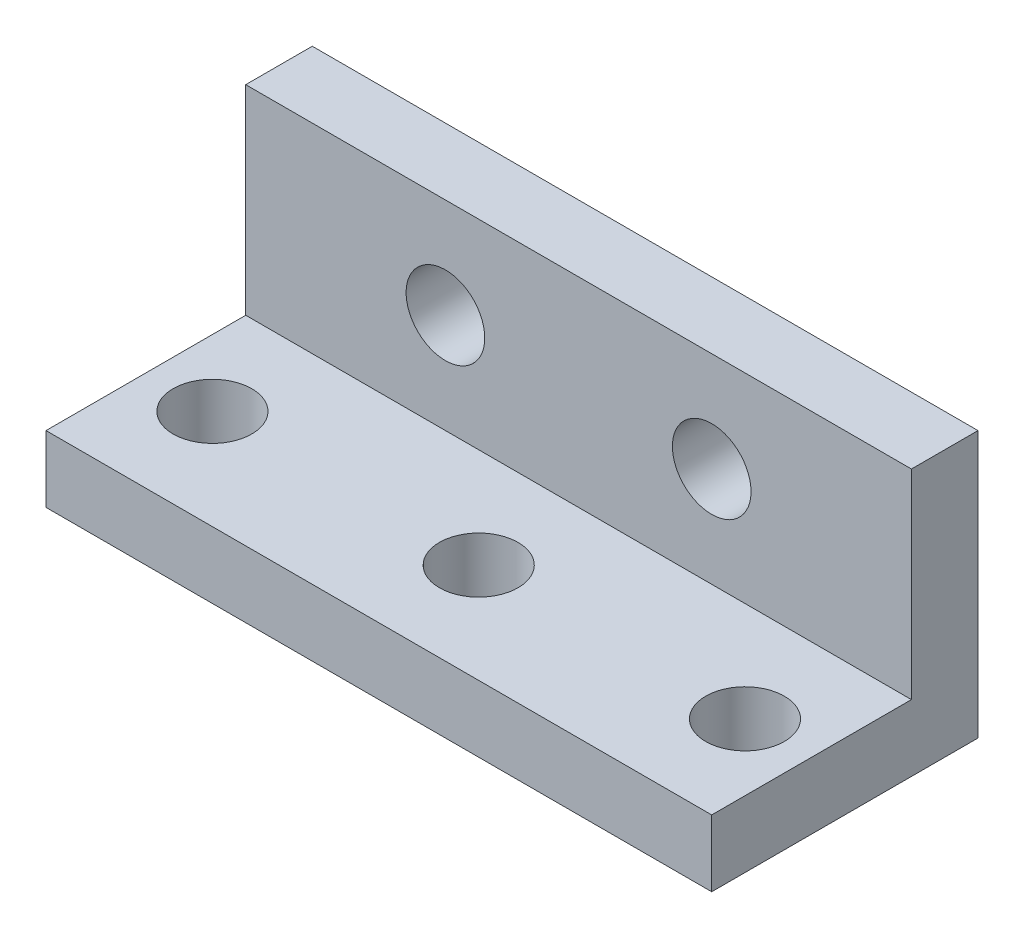
ISO-10303-21;
HEADER;
FILE_DESCRIPTION(('STEP AP214'),'2;1');
FILE_NAME('part.step','',(''),(''),'','','');
FILE_SCHEMA(('AUTOMOTIVE_DESIGN { 1 0 10303 214 1 1 1 1 }'));
ENDSEC;
DATA;
#1=APPLICATION_CONTEXT('core data for automotive mechanical design processes');
#2=APPLICATION_PROTOCOL_DEFINITION('international standard','automotive_design',2000,#1);
#3=PRODUCT_CONTEXT('',#1,'mechanical');
#4=PRODUCT('Part','Part','',(#3));
#5=PRODUCT_RELATED_PRODUCT_CATEGORY('part','',(#4));
#6=PRODUCT_DEFINITION_FORMATION('','',#4);
#7=PRODUCT_DEFINITION_CONTEXT('part definition',#1,'design');
#8=PRODUCT_DEFINITION('design','',#6,#7);
#9=PRODUCT_DEFINITION_SHAPE('','',#8);
#10=(LENGTH_UNIT() NAMED_UNIT(*) SI_UNIT(.MILLI.,.METRE.));
#11=(NAMED_UNIT(*) PLANE_ANGLE_UNIT() SI_UNIT($,.RADIAN.));
#12=(NAMED_UNIT(*) SI_UNIT($,.STERADIAN.) SOLID_ANGLE_UNIT());
#13=UNCERTAINTY_MEASURE_WITH_UNIT(LENGTH_MEASURE(1.E-05),#10,'distance_accuracy_value','');
#14=(GEOMETRIC_REPRESENTATION_CONTEXT(3) GLOBAL_UNCERTAINTY_ASSIGNED_CONTEXT((#13)) GLOBAL_UNIT_ASSIGNED_CONTEXT((#10,
#11,#12)) REPRESENTATION_CONTEXT('',''));
#15=CARTESIAN_POINT('',(0.,0.,0.));
#16=DIRECTION('',(0.,0.,1.));
#17=DIRECTION('',(1.,0.,0.));
#18=AXIS2_PLACEMENT_3D('',#15,#16,#17);
#19=CARTESIAN_POINT('',(25.4,0.,0.));
#20=DIRECTION('',(0.,0.,-1.));
#21=DIRECTION('',(-1.,0.,0.));
#22=AXIS2_PLACEMENT_3D('',#19,#20,#21);
#23=PLANE('',#22);
#24=DIRECTION('',(0.,-1.,0.));
#25=VECTOR('',#24,1.);
#26=CARTESIAN_POINT('',(25.4,0.,0.));
#27=LINE('',#26,#25);
#28=CARTESIAN_POINT('',(25.4,2.54,0.));
#29=VERTEX_POINT('',#28);
#30=CARTESIAN_POINT('',(25.4,0.,0.));
#31=VERTEX_POINT('',#30);
#32=EDGE_CURVE('E83',#29,#31,#27,.T.);
#33=ORIENTED_EDGE('',*,*,#32,.F.);
#34=DIRECTION('',(1.,0.,0.));
#35=VECTOR('',#34,1.);
#36=CARTESIAN_POINT('',(0.,2.54,0.));
#37=LINE('',#36,#35);
#38=CARTESIAN_POINT('',(0.,2.54,0.));
#39=VERTEX_POINT('',#38);
#40=EDGE_CURVE('E103',#39,#29,#37,.T.);
#41=ORIENTED_EDGE('',*,*,#40,.F.);
#42=DIRECTION('',(0.,-1.,0.));
#43=VECTOR('',#42,1.);
#44=CARTESIAN_POINT('',(0.,0.,0.));
#45=LINE('',#44,#43);
#46=CARTESIAN_POINT('',(0.,0.,0.));
#47=VERTEX_POINT('',#46);
#48=EDGE_CURVE('E111',#39,#47,#45,.T.);
#49=ORIENTED_EDGE('',*,*,#48,.T.);
#50=DIRECTION('',(-1.,0.,0.));
#51=VECTOR('',#50,1.);
#52=CARTESIAN_POINT('',(25.4,0.,0.));
#53=LINE('',#52,#51);
#54=EDGE_CURVE('E11',#31,#47,#53,.T.);
#55=ORIENTED_EDGE('',*,*,#54,.F.);
#56=EDGE_LOOP('',(#33,#41,#49,#55));
#57=FACE_BOUND('',#56,.T.);
#58=ADVANCED_FACE('F38',(#57),#23,.F.);
#59=CARTESIAN_POINT('',(25.4,0.,0.));
#60=DIRECTION('',(0.,1.,0.));
#61=DIRECTION('',(0.,0.,1.));
#62=AXIS2_PLACEMENT_3D('',#59,#60,#61);
#63=PLANE('',#62);
#64=CARTESIAN_POINT('',(2.54,0.,-3.81));
#65=DIRECTION('',(0.,1.,0.));
#66=DIRECTION('',(0.,0.,1.));
#67=AXIS2_PLACEMENT_3D('',#64,#65,#66);
#68=CIRCLE('',#67,1.5);
#69=CARTESIAN_POINT('',(2.54,0.,-2.31));
#70=VERTEX_POINT('',#69);
#71=EDGE_CURVE('E152',#70,#70,#68,.T.);
#72=ORIENTED_EDGE('',*,*,#71,.T.);
#73=EDGE_LOOP('',(#72));
#74=FACE_BOUND('',#73,.T.);
#75=CARTESIAN_POINT('',(22.86,0.,-3.81));
#76=DIRECTION('',(0.,1.,0.));
#77=DIRECTION('',(0.,0.,1.));
#78=AXIS2_PLACEMENT_3D('',#75,#76,#77);
#79=CIRCLE('',#78,1.5);
#80=CARTESIAN_POINT('',(22.86,0.,-2.31));
#81=VERTEX_POINT('',#80);
#82=EDGE_CURVE('E169',#81,#81,#79,.T.);
#83=ORIENTED_EDGE('',*,*,#82,.T.);
#84=EDGE_LOOP('',(#83));
#85=FACE_BOUND('',#84,.T.);
#86=CARTESIAN_POINT('',(12.7,0.,-3.81));
#87=DIRECTION('',(0.,1.,0.));
#88=DIRECTION('',(0.,0.,1.));
#89=AXIS2_PLACEMENT_3D('',#86,#87,#88);
#90=CIRCLE('',#89,1.5);
#91=CARTESIAN_POINT('',(12.7,0.,-2.31));
#92=VERTEX_POINT('',#91);
#93=EDGE_CURVE('E163',#92,#92,#90,.T.);
#94=ORIENTED_EDGE('',*,*,#93,.T.);
#95=EDGE_LOOP('',(#94));
#96=FACE_BOUND('',#95,.T.);
#97=DIRECTION('',(0.,0.,-1.));
#98=VECTOR('',#97,1.);
#99=CARTESIAN_POINT('',(0.,0.,0.));
#100=LINE('',#99,#98);
#101=CARTESIAN_POINT('',(0.,0.,-10.16));
#102=VERTEX_POINT('',#101);
#103=EDGE_CURVE('E115',#47,#102,#100,.T.);
#104=ORIENTED_EDGE('',*,*,#103,.T.);
#105=DIRECTION('',(-1.,0.,0.));
#106=VECTOR('',#105,1.);
#107=CARTESIAN_POINT('',(25.4,0.,-10.16));
#108=LINE('',#107,#106);
#109=CARTESIAN_POINT('',(25.4,0.,-10.16));
#110=VERTEX_POINT('',#109);
#111=EDGE_CURVE('E45',#110,#102,#108,.T.);
#112=ORIENTED_EDGE('',*,*,#111,.F.);
#113=DIRECTION('',(0.,0.,-1.));
#114=VECTOR('',#113,1.);
#115=CARTESIAN_POINT('',(25.4,0.,0.));
#116=LINE('',#115,#114);
#117=EDGE_CURVE('E138',#31,#110,#116,.T.);
#118=ORIENTED_EDGE('',*,*,#117,.F.);
#119=ORIENTED_EDGE('',*,*,#54,.T.);
#120=EDGE_LOOP('',(#104,#112,#118,#119));
#121=FACE_BOUND('',#120,.T.);
#122=ADVANCED_FACE('F178',(#74,#85,#96,#121),#63,.F.);
#123=CARTESIAN_POINT('',(25.4,0.,-10.16));
#124=DIRECTION('',(0.,0.,1.));
#125=DIRECTION('',(1.,0.,0.));
#126=AXIS2_PLACEMENT_3D('',#123,#124,#125);
#127=PLANE('',#126);
#128=CARTESIAN_POINT('',(7.62,6.35,-10.16));
#129=DIRECTION('',(0.,0.,1.));
#130=DIRECTION('',(1.,0.,0.));
#131=AXIS2_PLACEMENT_3D('',#128,#129,#130);
#132=CIRCLE('',#131,1.5);
#133=CARTESIAN_POINT('',(9.12,6.35,-10.16));
#134=VERTEX_POINT('',#133);
#135=EDGE_CURVE('E146',#134,#134,#132,.T.);
#136=ORIENTED_EDGE('',*,*,#135,.T.);
#137=EDGE_LOOP('',(#136));
#138=FACE_BOUND('',#137,.T.);
#139=CARTESIAN_POINT('',(17.78,6.35,-10.16));
#140=DIRECTION('',(0.,0.,1.));
#141=DIRECTION('',(1.,0.,0.));
#142=AXIS2_PLACEMENT_3D('',#139,#140,#141);
#143=CIRCLE('',#142,1.5);
#144=CARTESIAN_POINT('',(19.28,6.35,-10.16));
#145=VERTEX_POINT('',#144);
#146=EDGE_CURVE('E151',#145,#145,#143,.T.);
#147=ORIENTED_EDGE('',*,*,#146,.T.);
#148=EDGE_LOOP('',(#147));
#149=FACE_BOUND('',#148,.T.);
#150=DIRECTION('',(0.,1.,0.));
#151=VECTOR('',#150,1.);
#152=CARTESIAN_POINT('',(0.,0.,-10.16));
#153=LINE('',#152,#151);
#154=CARTESIAN_POINT('',(0.,10.16,-10.16));
#155=VERTEX_POINT('',#154);
#156=EDGE_CURVE('E78',#102,#155,#153,.T.);
#157=ORIENTED_EDGE('',*,*,#156,.T.);
#158=DIRECTION('',(-1.,0.,0.));
#159=VECTOR('',#158,1.);
#160=CARTESIAN_POINT('',(25.4,10.16,-10.16));
#161=LINE('',#160,#159);
#162=CARTESIAN_POINT('',(25.4,10.16,-10.16));
#163=VERTEX_POINT('',#162);
#164=EDGE_CURVE('E129',#163,#155,#161,.T.);
#165=ORIENTED_EDGE('',*,*,#164,.F.);
#166=DIRECTION('',(0.,1.,0.));
#167=VECTOR('',#166,1.);
#168=CARTESIAN_POINT('',(25.4,0.,-10.16));
#169=LINE('',#168,#167);
#170=EDGE_CURVE('E61',#110,#163,#169,.T.);
#171=ORIENTED_EDGE('',*,*,#170,.F.);
#172=ORIENTED_EDGE('',*,*,#111,.T.);
#173=EDGE_LOOP('',(#157,#165,#171,#172));
#174=FACE_BOUND('',#173,.T.);
#175=ADVANCED_FACE('F131',(#138,#149,#174),#127,.F.);
#176=CARTESIAN_POINT('',(25.4,10.16,0.));
#177=DIRECTION('',(0.,-1.,0.));
#178=DIRECTION('',(0.,0.,-1.));
#179=AXIS2_PLACEMENT_3D('',#176,#177,#178);
#180=PLANE('',#179);
#181=DIRECTION('',(0.,0.,1.));
#182=VECTOR('',#181,1.);
#183=CARTESIAN_POINT('',(0.,10.16,0.));
#184=LINE('',#183,#182);
#185=CARTESIAN_POINT('',(0.,10.16,-7.62));
#186=VERTEX_POINT('',#185);
#187=EDGE_CURVE('E126',#155,#186,#184,.T.);
#188=ORIENTED_EDGE('',*,*,#187,.T.);
#189=DIRECTION('',(1.,0.,0.));
#190=VECTOR('',#189,1.);
#191=CARTESIAN_POINT('',(0.,10.16,-7.62));
#192=LINE('',#191,#190);
#193=CARTESIAN_POINT('',(25.4,10.16,-7.62));
#194=VERTEX_POINT('',#193);
#195=EDGE_CURVE('E116',#186,#194,#192,.T.);
#196=ORIENTED_EDGE('',*,*,#195,.T.);
#197=DIRECTION('',(0.,0.,1.));
#198=VECTOR('',#197,1.);
#199=CARTESIAN_POINT('',(25.4,10.16,0.));
#200=LINE('',#199,#198);
#201=EDGE_CURVE('E122',#163,#194,#200,.T.);
#202=ORIENTED_EDGE('',*,*,#201,.F.);
#203=ORIENTED_EDGE('',*,*,#164,.T.);
#204=EDGE_LOOP('',(#188,#196,#202,#203));
#205=FACE_BOUND('',#204,.T.);
#206=ADVANCED_FACE('F135',(#205),#180,.F.);
#207=CARTESIAN_POINT('',(25.4,0.,0.));
#208=DIRECTION('',(-1.,0.,0.));
#209=DIRECTION('',(0.,0.,1.));
#210=AXIS2_PLACEMENT_3D('',#207,#208,#209);
#211=PLANE('',#210);
#212=ORIENTED_EDGE('',*,*,#201,.T.);
#213=DIRECTION('',(0.,1.,0.));
#214=VECTOR('',#213,1.);
#215=CARTESIAN_POINT('',(25.4,10.16,-7.62));
#216=LINE('',#215,#214);
#217=CARTESIAN_POINT('',(25.4,2.54,-7.62));
#218=VERTEX_POINT('',#217);
#219=EDGE_CURVE('E107',#218,#194,#216,.T.);
#220=ORIENTED_EDGE('',*,*,#219,.F.);
#221=DIRECTION('',(0.,0.,-1.));
#222=VECTOR('',#221,1.);
#223=CARTESIAN_POINT('',(25.4,2.54,0.));
#224=LINE('',#223,#222);
#225=EDGE_CURVE('E144',#29,#218,#224,.T.);
#226=ORIENTED_EDGE('',*,*,#225,.F.);
#227=ORIENTED_EDGE('',*,*,#32,.T.);
#228=ORIENTED_EDGE('',*,*,#117,.T.);
#229=ORIENTED_EDGE('',*,*,#170,.T.);
#230=EDGE_LOOP('',(#212,#220,#226,#227,#228,#229));
#231=FACE_BOUND('',#230,.T.);
#232=ADVANCED_FACE('F223',(#231),#211,.F.);
#233=CARTESIAN_POINT('',(0.,0.,0.));
#234=DIRECTION('',(-1.,0.,0.));
#235=DIRECTION('',(0.,0.,1.));
#236=AXIS2_PLACEMENT_3D('',#233,#234,#235);
#237=PLANE('',#236);
#238=DIRECTION('',(0.,1.,0.));
#239=VECTOR('',#238,1.);
#240=CARTESIAN_POINT('',(0.,10.16,-7.62));
#241=LINE('',#240,#239);
#242=CARTESIAN_POINT('',(0.,2.54,-7.62));
#243=VERTEX_POINT('',#242);
#244=EDGE_CURVE('E52',#243,#186,#241,.T.);
#245=ORIENTED_EDGE('',*,*,#244,.T.);
#246=ORIENTED_EDGE('',*,*,#187,.F.);
#247=ORIENTED_EDGE('',*,*,#156,.F.);
#248=ORIENTED_EDGE('',*,*,#103,.F.);
#249=ORIENTED_EDGE('',*,*,#48,.F.);
#250=DIRECTION('',(0.,0.,-1.));
#251=VECTOR('',#250,1.);
#252=CARTESIAN_POINT('',(0.,2.54,0.));
#253=LINE('',#252,#251);
#254=EDGE_CURVE('E99',#39,#243,#253,.T.);
#255=ORIENTED_EDGE('',*,*,#254,.T.);
#256=EDGE_LOOP('',(#245,#246,#247,#248,#249,#255));
#257=FACE_BOUND('',#256,.T.);
#258=ADVANCED_FACE('F114',(#257),#237,.T.);
#259=CARTESIAN_POINT('',(0.,10.16,-7.62));
#260=DIRECTION('',(0.,0.,-1.));
#261=DIRECTION('',(0.,1.,0.));
#262=AXIS2_PLACEMENT_3D('',#259,#260,#261);
#263=PLANE('',#262);
#264=CARTESIAN_POINT('',(7.62,6.35,-7.62));
#265=DIRECTION('',(0.,0.,1.));
#266=DIRECTION('',(1.,0.,0.));
#267=AXIS2_PLACEMENT_3D('',#264,#265,#266);
#268=CIRCLE('',#267,1.5);
#269=CARTESIAN_POINT('',(9.12,6.35,-7.62));
#270=VERTEX_POINT('',#269);
#271=EDGE_CURVE('E155',#270,#270,#268,.T.);
#272=ORIENTED_EDGE('',*,*,#271,.F.);
#273=EDGE_LOOP('',(#272));
#274=FACE_BOUND('',#273,.T.);
#275=CARTESIAN_POINT('',(17.78,6.35,-7.62));
#276=DIRECTION('',(0.,0.,1.));
#277=DIRECTION('',(1.,0.,0.));
#278=AXIS2_PLACEMENT_3D('',#275,#276,#277);
#279=CIRCLE('',#278,1.5);
#280=CARTESIAN_POINT('',(19.28,6.35,-7.62));
#281=VERTEX_POINT('',#280);
#282=EDGE_CURVE('E148',#281,#281,#279,.T.);
#283=ORIENTED_EDGE('',*,*,#282,.F.);
#284=EDGE_LOOP('',(#283));
#285=FACE_BOUND('',#284,.T.);
#286=ORIENTED_EDGE('',*,*,#219,.T.);
#287=ORIENTED_EDGE('',*,*,#195,.F.);
#288=ORIENTED_EDGE('',*,*,#244,.F.);
#289=DIRECTION('',(1.,0.,0.));
#290=VECTOR('',#289,1.);
#291=CARTESIAN_POINT('',(0.,2.54,-7.62));
#292=LINE('',#291,#290);
#293=EDGE_CURVE('E104',#243,#218,#292,.T.);
#294=ORIENTED_EDGE('',*,*,#293,.T.);
#295=EDGE_LOOP('',(#286,#287,#288,#294));
#296=FACE_BOUND('',#295,.T.);
#297=ADVANCED_FACE('F191',(#274,#285,#296),#263,.F.);
#298=CARTESIAN_POINT('',(0.,2.54,0.));
#299=DIRECTION('',(0.,-1.,0.));
#300=DIRECTION('',(0.,0.,-1.));
#301=AXIS2_PLACEMENT_3D('',#298,#299,#300);
#302=PLANE('',#301);
#303=CARTESIAN_POINT('',(2.54,2.54,-3.81));
#304=DIRECTION('',(0.,1.,0.));
#305=DIRECTION('',(0.,0.,1.));
#306=AXIS2_PLACEMENT_3D('',#303,#304,#305);
#307=CIRCLE('',#306,1.5);
#308=CARTESIAN_POINT('',(2.54,2.54,-2.31));
#309=VERTEX_POINT('',#308);
#310=EDGE_CURVE('E172',#309,#309,#307,.T.);
#311=ORIENTED_EDGE('',*,*,#310,.F.);
#312=EDGE_LOOP('',(#311));
#313=FACE_BOUND('',#312,.T.);
#314=CARTESIAN_POINT('',(22.86,2.54,-3.81));
#315=DIRECTION('',(0.,1.,0.));
#316=DIRECTION('',(0.,0.,1.));
#317=AXIS2_PLACEMENT_3D('',#314,#315,#316);
#318=CIRCLE('',#317,1.5);
#319=CARTESIAN_POINT('',(22.86,2.54,-2.31));
#320=VERTEX_POINT('',#319);
#321=EDGE_CURVE('E166',#320,#320,#318,.T.);
#322=ORIENTED_EDGE('',*,*,#321,.F.);
#323=EDGE_LOOP('',(#322));
#324=FACE_BOUND('',#323,.T.);
#325=CARTESIAN_POINT('',(12.7,2.54,-3.81));
#326=DIRECTION('',(0.,1.,0.));
#327=DIRECTION('',(0.,0.,1.));
#328=AXIS2_PLACEMENT_3D('',#325,#326,#327);
#329=CIRCLE('',#328,1.5);
#330=CARTESIAN_POINT('',(12.7,2.54,-2.31));
#331=VERTEX_POINT('',#330);
#332=EDGE_CURVE('E160',#331,#331,#329,.T.);
#333=ORIENTED_EDGE('',*,*,#332,.F.);
#334=EDGE_LOOP('',(#333));
#335=FACE_BOUND('',#334,.T.);
#336=ORIENTED_EDGE('',*,*,#225,.T.);
#337=ORIENTED_EDGE('',*,*,#293,.F.);
#338=ORIENTED_EDGE('',*,*,#254,.F.);
#339=ORIENTED_EDGE('',*,*,#40,.T.);
#340=EDGE_LOOP('',(#336,#337,#338,#339));
#341=FACE_BOUND('',#340,.T.);
#342=ADVANCED_FACE('F102',(#313,#324,#335,#341),#302,.F.);
#343=CARTESIAN_POINT('',(17.78,6.35,-10.16));
#344=DIRECTION('',(0.,0.,1.));
#345=DIRECTION('',(1.,0.,0.));
#346=AXIS2_PLACEMENT_3D('',#343,#344,#345);
#347=CYLINDRICAL_SURFACE('',#346,1.5);
#348=ORIENTED_EDGE('',*,*,#146,.F.);
#349=EDGE_LOOP('',(#348));
#350=FACE_BOUND('',#349,.T.);
#351=ORIENTED_EDGE('',*,*,#282,.T.);
#352=EDGE_LOOP('',(#351));
#353=FACE_BOUND('',#352,.T.);
#354=ADVANCED_FACE('F190',(#350,#353),#347,.F.);
#355=CARTESIAN_POINT('',(7.62,6.35,-10.16));
#356=DIRECTION('',(0.,0.,1.));
#357=DIRECTION('',(1.,0.,0.));
#358=AXIS2_PLACEMENT_3D('',#355,#356,#357);
#359=CYLINDRICAL_SURFACE('',#358,1.5);
#360=ORIENTED_EDGE('',*,*,#135,.F.);
#361=EDGE_LOOP('',(#360));
#362=FACE_BOUND('',#361,.T.);
#363=ORIENTED_EDGE('',*,*,#271,.T.);
#364=EDGE_LOOP('',(#363));
#365=FACE_BOUND('',#364,.T.);
#366=ADVANCED_FACE('F199',(#362,#365),#359,.F.);
#367=CARTESIAN_POINT('',(12.7,0.,-3.81));
#368=DIRECTION('',(0.,1.,0.));
#369=DIRECTION('',(0.,0.,1.));
#370=AXIS2_PLACEMENT_3D('',#367,#368,#369);
#371=CYLINDRICAL_SURFACE('',#370,1.5);
#372=ORIENTED_EDGE('',*,*,#93,.F.);
#373=EDGE_LOOP('',(#372));
#374=FACE_BOUND('',#373,.T.);
#375=ORIENTED_EDGE('',*,*,#332,.T.);
#376=EDGE_LOOP('',(#375));
#377=FACE_BOUND('',#376,.T.);
#378=ADVANCED_FACE('F197',(#374,#377),#371,.F.);
#379=CARTESIAN_POINT('',(22.86,0.,-3.81));
#380=DIRECTION('',(0.,1.,0.));
#381=DIRECTION('',(0.,0.,1.));
#382=AXIS2_PLACEMENT_3D('',#379,#380,#381);
#383=CYLINDRICAL_SURFACE('',#382,1.5);
#384=ORIENTED_EDGE('',*,*,#82,.F.);
#385=EDGE_LOOP('',(#384));
#386=FACE_BOUND('',#385,.T.);
#387=ORIENTED_EDGE('',*,*,#321,.T.);
#388=EDGE_LOOP('',(#387));
#389=FACE_BOUND('',#388,.T.);
#390=ADVANCED_FACE('F184',(#386,#389),#383,.F.);
#391=CARTESIAN_POINT('',(2.54,0.,-3.81));
#392=DIRECTION('',(0.,1.,0.));
#393=DIRECTION('',(0.,0.,1.));
#394=AXIS2_PLACEMENT_3D('',#391,#392,#393);
#395=CYLINDRICAL_SURFACE('',#394,1.5);
#396=ORIENTED_EDGE('',*,*,#71,.F.);
#397=EDGE_LOOP('',(#396));
#398=FACE_BOUND('',#397,.T.);
#399=ORIENTED_EDGE('',*,*,#310,.T.);
#400=EDGE_LOOP('',(#399));
#401=FACE_BOUND('',#400,.T.);
#402=ADVANCED_FACE('F181',(#398,#401),#395,.F.);
#403=CLOSED_SHELL('',(#58,#122,#175,#206,#232,#258,#297,#342,#354,#366,#378,#390,#402));
#404=MANIFOLD_SOLID_BREP('B2',#403);
#405=ADVANCED_BREP_SHAPE_REPRESENTATION('',(#18,#404),#14);
#406=SHAPE_DEFINITION_REPRESENTATION(#9,#405);
ENDSEC;
END-ISO-10303-21;
